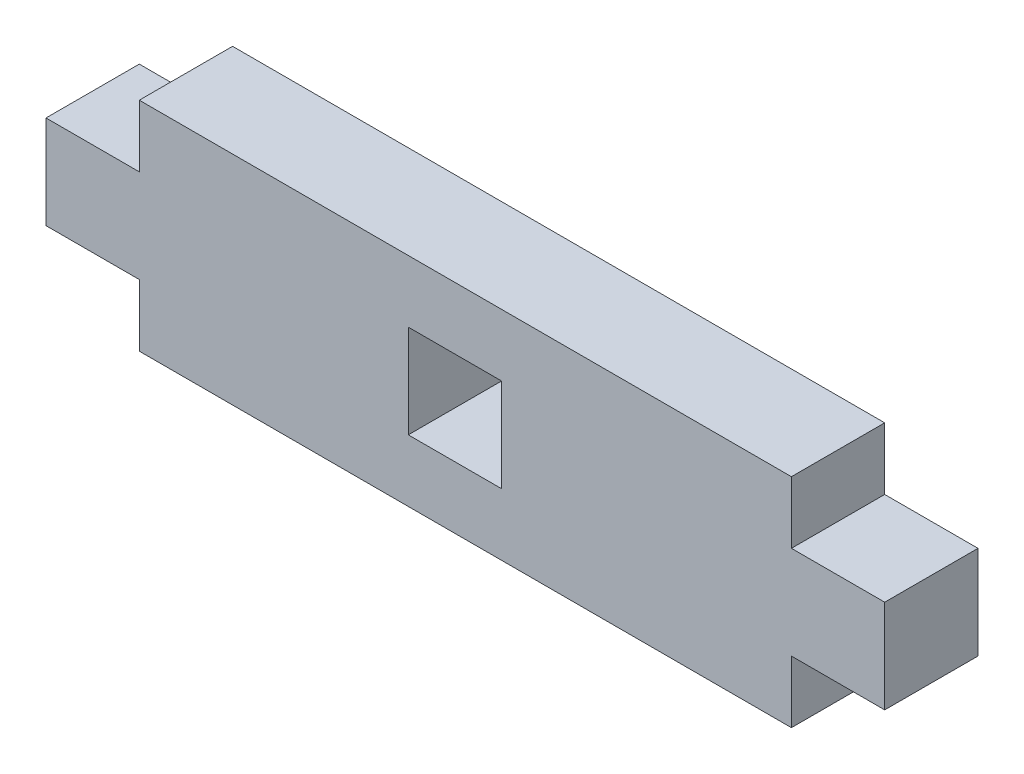
ISO-10303-21;
HEADER;
FILE_DESCRIPTION(('STEP AP214'),'2;1');
FILE_NAME('part.step','',(''),(''),'','','');
FILE_SCHEMA(('AUTOMOTIVE_DESIGN { 1 0 10303 214 1 1 1 1 }'));
ENDSEC;
DATA;
#1=APPLICATION_CONTEXT('core data for automotive mechanical design processes');
#2=APPLICATION_PROTOCOL_DEFINITION('international standard','automotive_design',2000,#1);
#3=PRODUCT_CONTEXT('',#1,'mechanical');
#4=PRODUCT('Part','Part','',(#3));
#5=PRODUCT_RELATED_PRODUCT_CATEGORY('part','',(#4));
#6=PRODUCT_DEFINITION_FORMATION('','',#4);
#7=PRODUCT_DEFINITION_CONTEXT('part definition',#1,'design');
#8=PRODUCT_DEFINITION('design','',#6,#7);
#9=PRODUCT_DEFINITION_SHAPE('','',#8);
#10=(LENGTH_UNIT() NAMED_UNIT(*) SI_UNIT(.MILLI.,.METRE.));
#11=(NAMED_UNIT(*) PLANE_ANGLE_UNIT() SI_UNIT($,.RADIAN.));
#12=(NAMED_UNIT(*) SI_UNIT($,.STERADIAN.) SOLID_ANGLE_UNIT());
#13=UNCERTAINTY_MEASURE_WITH_UNIT(LENGTH_MEASURE(1.E-05),#10,'distance_accuracy_value','');
#14=(GEOMETRIC_REPRESENTATION_CONTEXT(3) GLOBAL_UNCERTAINTY_ASSIGNED_CONTEXT((#13)) GLOBAL_UNIT_ASSIGNED_CONTEXT((#10,
#11,#12)) REPRESENTATION_CONTEXT('',''));
#15=CARTESIAN_POINT('',(0.,0.,0.));
#16=DIRECTION('',(0.,0.,1.));
#17=DIRECTION('',(1.,0.,0.));
#18=AXIS2_PLACEMENT_3D('',#15,#16,#17);
#19=CARTESIAN_POINT('',(5.15,3.425,5.15));
#20=DIRECTION('',(0.,1.,0.));
#21=DIRECTION('',(-1.,0.,0.));
#22=AXIS2_PLACEMENT_3D('',#19,#20,#21);
#23=PLANE('',#22);
#24=DIRECTION('',(1.,0.,0.));
#25=VECTOR('',#24,1.);
#26=CARTESIAN_POINT('',(5.15,3.425,0.));
#27=LINE('',#26,#25);
#28=CARTESIAN_POINT('',(0.,3.425,0.));
#29=VERTEX_POINT('',#28);
#30=CARTESIAN_POINT('',(5.15,3.425,0.));
#31=VERTEX_POINT('',#30);
#32=EDGE_CURVE('E178',#29,#31,#27,.T.);
#33=ORIENTED_EDGE('',*,*,#32,.T.);
#34=DIRECTION('',(0.,0.,-1.));
#35=VECTOR('',#34,1.);
#36=CARTESIAN_POINT('',(5.15,3.425,5.15));
#37=LINE('',#36,#35);
#38=CARTESIAN_POINT('',(5.15,3.425,5.15));
#39=VERTEX_POINT('',#38);
#40=EDGE_CURVE('E11',#39,#31,#37,.T.);
#41=ORIENTED_EDGE('',*,*,#40,.F.);
#42=DIRECTION('',(1.,0.,0.));
#43=VECTOR('',#42,1.);
#44=CARTESIAN_POINT('',(5.15,3.425,5.15));
#45=LINE('',#44,#43);
#46=CARTESIAN_POINT('',(0.,3.425,5.15));
#47=VERTEX_POINT('',#46);
#48=EDGE_CURVE('E182',#47,#39,#45,.T.);
#49=ORIENTED_EDGE('',*,*,#48,.F.);
#50=DIRECTION('',(0.,0.,-1.));
#51=VECTOR('',#50,1.);
#52=CARTESIAN_POINT('',(0.,3.425,5.15));
#53=LINE('',#52,#51);
#54=EDGE_CURVE('E208',#47,#29,#53,.T.);
#55=ORIENTED_EDGE('',*,*,#54,.T.);
#56=EDGE_LOOP('',(#33,#41,#49,#55));
#57=FACE_BOUND('',#56,.T.);
#58=ADVANCED_FACE('F33',(#57),#23,.F.);
#59=CARTESIAN_POINT('',(5.15,0.,5.15));
#60=DIRECTION('',(1.,0.,0.));
#61=DIRECTION('',(0.,1.,0.));
#62=AXIS2_PLACEMENT_3D('',#59,#60,#61);
#63=PLANE('',#62);
#64=DIRECTION('',(0.,-1.,0.));
#65=VECTOR('',#64,1.);
#66=CARTESIAN_POINT('',(5.15,0.,0.));
#67=LINE('',#66,#65);
#68=CARTESIAN_POINT('',(5.15,0.,0.));
#69=VERTEX_POINT('',#68);
#70=EDGE_CURVE('E211',#31,#69,#67,.T.);
#71=ORIENTED_EDGE('',*,*,#70,.T.);
#72=DIRECTION('',(0.,0.,-1.));
#73=VECTOR('',#72,1.);
#74=CARTESIAN_POINT('',(5.15,0.,5.15));
#75=LINE('',#74,#73);
#76=CARTESIAN_POINT('',(5.15,0.,5.15));
#77=VERTEX_POINT('',#76);
#78=EDGE_CURVE('E40',#77,#69,#75,.T.);
#79=ORIENTED_EDGE('',*,*,#78,.F.);
#80=DIRECTION('',(0.,-1.,0.));
#81=VECTOR('',#80,1.);
#82=CARTESIAN_POINT('',(5.15,0.,5.15));
#83=LINE('',#82,#81);
#84=EDGE_CURVE('E185',#39,#77,#83,.T.);
#85=ORIENTED_EDGE('',*,*,#84,.F.);
#86=ORIENTED_EDGE('',*,*,#40,.T.);
#87=EDGE_LOOP('',(#71,#79,#85,#86));
#88=FACE_BOUND('',#87,.T.);
#89=ADVANCED_FACE('F286',(#88),#63,.F.);
#90=CARTESIAN_POINT('',(5.15,0.,5.15));
#91=DIRECTION('',(0.,1.,0.));
#92=DIRECTION('',(0.,0.,1.));
#93=AXIS2_PLACEMENT_3D('',#90,#91,#92);
#94=PLANE('',#93);
#95=DIRECTION('',(1.,0.,0.));
#96=VECTOR('',#95,1.);
#97=CARTESIAN_POINT('',(5.15,0.,0.));
#98=LINE('',#97,#96);
#99=CARTESIAN_POINT('',(41.15,0.,0.));
#100=VERTEX_POINT('',#99);
#101=EDGE_CURVE('E213',#69,#100,#98,.T.);
#102=ORIENTED_EDGE('',*,*,#101,.T.);
#103=DIRECTION('',(0.,0.,-1.));
#104=VECTOR('',#103,1.);
#105=CARTESIAN_POINT('',(41.15,0.,5.15));
#106=LINE('',#105,#104);
#107=CARTESIAN_POINT('',(41.15,0.,5.15));
#108=VERTEX_POINT('',#107);
#109=EDGE_CURVE('E258',#108,#100,#106,.T.);
#110=ORIENTED_EDGE('',*,*,#109,.F.);
#111=DIRECTION('',(1.,0.,0.));
#112=VECTOR('',#111,1.);
#113=CARTESIAN_POINT('',(5.15,0.,5.15));
#114=LINE('',#113,#112);
#115=EDGE_CURVE('E188',#77,#108,#114,.T.);
#116=ORIENTED_EDGE('',*,*,#115,.F.);
#117=ORIENTED_EDGE('',*,*,#78,.T.);
#118=EDGE_LOOP('',(#102,#110,#116,#117));
#119=FACE_BOUND('',#118,.T.);
#120=ADVANCED_FACE('F265',(#119),#94,.F.);
#121=CARTESIAN_POINT('',(41.15,0.,5.15));
#122=DIRECTION('',(-1.,0.,0.));
#123=DIRECTION('',(0.,0.,1.));
#124=AXIS2_PLACEMENT_3D('',#121,#122,#123);
#125=PLANE('',#124);
#126=DIRECTION('',(0.,1.,0.));
#127=VECTOR('',#126,1.);
#128=CARTESIAN_POINT('',(41.15,0.,0.));
#129=LINE('',#128,#127);
#130=CARTESIAN_POINT('',(41.15,3.425,0.));
#131=VERTEX_POINT('',#130);
#132=EDGE_CURVE('E215',#100,#131,#129,.T.);
#133=ORIENTED_EDGE('',*,*,#132,.T.);
#134=DIRECTION('',(0.,0.,-1.));
#135=VECTOR('',#134,1.);
#136=CARTESIAN_POINT('',(41.15,3.425,5.15));
#137=LINE('',#136,#135);
#138=CARTESIAN_POINT('',(41.15,3.425,5.15));
#139=VERTEX_POINT('',#138);
#140=EDGE_CURVE('E255',#139,#131,#137,.T.);
#141=ORIENTED_EDGE('',*,*,#140,.F.);
#142=DIRECTION('',(0.,1.,0.));
#143=VECTOR('',#142,1.);
#144=CARTESIAN_POINT('',(41.15,0.,5.15));
#145=LINE('',#144,#143);
#146=EDGE_CURVE('E190',#108,#139,#145,.T.);
#147=ORIENTED_EDGE('',*,*,#146,.F.);
#148=ORIENTED_EDGE('',*,*,#109,.T.);
#149=EDGE_LOOP('',(#133,#141,#147,#148));
#150=FACE_BOUND('',#149,.T.);
#151=ADVANCED_FACE('F274',(#150),#125,.F.);
#152=CARTESIAN_POINT('',(46.3,3.425,5.15));
#153=DIRECTION('',(0.,1.,0.));
#154=DIRECTION('',(0.,0.,1.));
#155=AXIS2_PLACEMENT_3D('',#152,#153,#154);
#156=PLANE('',#155);
#157=DIRECTION('',(1.,0.,0.));
#158=VECTOR('',#157,1.);
#159=CARTESIAN_POINT('',(46.3,3.425,0.));
#160=LINE('',#159,#158);
#161=CARTESIAN_POINT('',(46.3,3.425,0.));
#162=VERTEX_POINT('',#161);
#163=EDGE_CURVE('E217',#131,#162,#160,.T.);
#164=ORIENTED_EDGE('',*,*,#163,.T.);
#165=DIRECTION('',(0.,0.,-1.));
#166=VECTOR('',#165,1.);
#167=CARTESIAN_POINT('',(46.3,3.425,5.15));
#168=LINE('',#167,#166);
#169=CARTESIAN_POINT('',(46.3,3.425,5.15));
#170=VERTEX_POINT('',#169);
#171=EDGE_CURVE('E252',#170,#162,#168,.T.);
#172=ORIENTED_EDGE('',*,*,#171,.F.);
#173=DIRECTION('',(1.,0.,0.));
#174=VECTOR('',#173,1.);
#175=CARTESIAN_POINT('',(46.3,3.425,5.15));
#176=LINE('',#175,#174);
#177=EDGE_CURVE('E192',#139,#170,#176,.T.);
#178=ORIENTED_EDGE('',*,*,#177,.F.);
#179=ORIENTED_EDGE('',*,*,#140,.T.);
#180=EDGE_LOOP('',(#164,#172,#178,#179));
#181=FACE_BOUND('',#180,.T.);
#182=ADVANCED_FACE('F278',(#181),#156,.F.);
#183=CARTESIAN_POINT('',(46.3,8.575,5.15));
#184=DIRECTION('',(-1.,0.,0.));
#185=DIRECTION('',(0.,-1.,0.));
#186=AXIS2_PLACEMENT_3D('',#183,#184,#185);
#187=PLANE('',#186);
#188=DIRECTION('',(0.,1.,0.));
#189=VECTOR('',#188,1.);
#190=CARTESIAN_POINT('',(46.3,8.575,0.));
#191=LINE('',#190,#189);
#192=CARTESIAN_POINT('',(46.3,8.575,0.));
#193=VERTEX_POINT('',#192);
#194=EDGE_CURVE('E219',#162,#193,#191,.T.);
#195=ORIENTED_EDGE('',*,*,#194,.T.);
#196=DIRECTION('',(0.,0.,-1.));
#197=VECTOR('',#196,1.);
#198=CARTESIAN_POINT('',(46.3,8.575,5.15));
#199=LINE('',#198,#197);
#200=CARTESIAN_POINT('',(46.3,8.575,5.15));
#201=VERTEX_POINT('',#200);
#202=EDGE_CURVE('E249',#201,#193,#199,.T.);
#203=ORIENTED_EDGE('',*,*,#202,.F.);
#204=DIRECTION('',(0.,1.,0.));
#205=VECTOR('',#204,1.);
#206=CARTESIAN_POINT('',(46.3,8.575,5.15));
#207=LINE('',#206,#205);
#208=EDGE_CURVE('E194',#170,#201,#207,.T.);
#209=ORIENTED_EDGE('',*,*,#208,.F.);
#210=ORIENTED_EDGE('',*,*,#171,.T.);
#211=EDGE_LOOP('',(#195,#203,#209,#210));
#212=FACE_BOUND('',#211,.T.);
#213=ADVANCED_FACE('F319',(#212),#187,.F.);
#214=CARTESIAN_POINT('',(41.15,8.575,5.15));
#215=DIRECTION('',(0.,-1.,0.));
#216=DIRECTION('',(0.,0.,-1.));
#217=AXIS2_PLACEMENT_3D('',#214,#215,#216);
#218=PLANE('',#217);
#219=DIRECTION('',(-1.,0.,0.));
#220=VECTOR('',#219,1.);
#221=CARTESIAN_POINT('',(41.15,8.575,0.));
#222=LINE('',#221,#220);
#223=CARTESIAN_POINT('',(41.15,8.575,0.));
#224=VERTEX_POINT('',#223);
#225=EDGE_CURVE('E221',#193,#224,#222,.T.);
#226=ORIENTED_EDGE('',*,*,#225,.T.);
#227=DIRECTION('',(0.,0.,-1.));
#228=VECTOR('',#227,1.);
#229=CARTESIAN_POINT('',(41.15,8.575,5.15));
#230=LINE('',#229,#228);
#231=CARTESIAN_POINT('',(41.15,8.575,5.15));
#232=VERTEX_POINT('',#231);
#233=EDGE_CURVE('E246',#232,#224,#230,.T.);
#234=ORIENTED_EDGE('',*,*,#233,.F.);
#235=DIRECTION('',(-1.,0.,0.));
#236=VECTOR('',#235,1.);
#237=CARTESIAN_POINT('',(41.15,8.575,5.15));
#238=LINE('',#237,#236);
#239=EDGE_CURVE('E196',#201,#232,#238,.T.);
#240=ORIENTED_EDGE('',*,*,#239,.F.);
#241=ORIENTED_EDGE('',*,*,#202,.T.);
#242=EDGE_LOOP('',(#226,#234,#240,#241));
#243=FACE_BOUND('',#242,.T.);
#244=ADVANCED_FACE('F317',(#243),#218,.F.);
#245=CARTESIAN_POINT('',(41.15,8.575,5.15));
#246=DIRECTION('',(-1.,0.,0.));
#247=DIRECTION('',(0.,0.,1.));
#248=AXIS2_PLACEMENT_3D('',#245,#246,#247);
#249=PLANE('',#248);
#250=DIRECTION('',(0.,1.,0.));
#251=VECTOR('',#250,1.);
#252=CARTESIAN_POINT('',(41.15,8.575,0.));
#253=LINE('',#252,#251);
#254=CARTESIAN_POINT('',(41.15,12.,0.));
#255=VERTEX_POINT('',#254);
#256=EDGE_CURVE('E223',#224,#255,#253,.T.);
#257=ORIENTED_EDGE('',*,*,#256,.T.);
#258=DIRECTION('',(0.,0.,-1.));
#259=VECTOR('',#258,1.);
#260=CARTESIAN_POINT('',(41.15,12.,5.15));
#261=LINE('',#260,#259);
#262=CARTESIAN_POINT('',(41.15,12.,5.15));
#263=VERTEX_POINT('',#262);
#264=EDGE_CURVE('E243',#263,#255,#261,.T.);
#265=ORIENTED_EDGE('',*,*,#264,.F.);
#266=DIRECTION('',(0.,1.,0.));
#267=VECTOR('',#266,1.);
#268=CARTESIAN_POINT('',(41.15,8.575,5.15));
#269=LINE('',#268,#267);
#270=EDGE_CURVE('E198',#232,#263,#269,.T.);
#271=ORIENTED_EDGE('',*,*,#270,.F.);
#272=ORIENTED_EDGE('',*,*,#233,.T.);
#273=EDGE_LOOP('',(#257,#265,#271,#272));
#274=FACE_BOUND('',#273,.T.);
#275=ADVANCED_FACE('F313',(#274),#249,.F.);
#276=CARTESIAN_POINT('',(41.15,12.,5.15));
#277=DIRECTION('',(0.,-1.,0.));
#278=DIRECTION('',(1.,0.,0.));
#279=AXIS2_PLACEMENT_3D('',#276,#277,#278);
#280=PLANE('',#279);
#281=DIRECTION('',(-1.,0.,0.));
#282=VECTOR('',#281,1.);
#283=CARTESIAN_POINT('',(41.15,12.,0.));
#284=LINE('',#283,#282);
#285=CARTESIAN_POINT('',(5.15000000000002,12.,0.));
#286=VERTEX_POINT('',#285);
#287=EDGE_CURVE('E225',#255,#286,#284,.T.);
#288=ORIENTED_EDGE('',*,*,#287,.T.);
#289=DIRECTION('',(0.,0.,-1.));
#290=VECTOR('',#289,1.);
#291=CARTESIAN_POINT('',(5.15000000000002,12.,5.15));
#292=LINE('',#291,#290);
#293=CARTESIAN_POINT('',(5.15000000000002,12.,5.15));
#294=VERTEX_POINT('',#293);
#295=EDGE_CURVE('E240',#294,#286,#292,.T.);
#296=ORIENTED_EDGE('',*,*,#295,.F.);
#297=DIRECTION('',(-1.,0.,0.));
#298=VECTOR('',#297,1.);
#299=CARTESIAN_POINT('',(41.15,12.,5.15));
#300=LINE('',#299,#298);
#301=EDGE_CURVE('E200',#263,#294,#300,.T.);
#302=ORIENTED_EDGE('',*,*,#301,.F.);
#303=ORIENTED_EDGE('',*,*,#264,.T.);
#304=EDGE_LOOP('',(#288,#296,#302,#303));
#305=FACE_BOUND('',#304,.T.);
#306=ADVANCED_FACE('F308',(#305),#280,.F.);
#307=CARTESIAN_POINT('',(5.15,8.575,5.15));
#308=DIRECTION('',(1.,0.,0.));
#309=DIRECTION('',(0.,1.,0.));
#310=AXIS2_PLACEMENT_3D('',#307,#308,#309);
#311=PLANE('',#310);
#312=DIRECTION('',(0.,-1.,0.));
#313=VECTOR('',#312,1.);
#314=CARTESIAN_POINT('',(5.15,8.575,0.));
#315=LINE('',#314,#313);
#316=CARTESIAN_POINT('',(5.15,8.575,0.));
#317=VERTEX_POINT('',#316);
#318=EDGE_CURVE('E227',#286,#317,#315,.T.);
#319=ORIENTED_EDGE('',*,*,#318,.T.);
#320=DIRECTION('',(0.,0.,-1.));
#321=VECTOR('',#320,1.);
#322=CARTESIAN_POINT('',(5.15,8.575,5.15));
#323=LINE('',#322,#321);
#324=CARTESIAN_POINT('',(5.15,8.575,5.15));
#325=VERTEX_POINT('',#324);
#326=EDGE_CURVE('E237',#325,#317,#323,.T.);
#327=ORIENTED_EDGE('',*,*,#326,.F.);
#328=DIRECTION('',(0.,-1.,0.));
#329=VECTOR('',#328,1.);
#330=CARTESIAN_POINT('',(5.15,8.575,5.15));
#331=LINE('',#330,#329);
#332=EDGE_CURVE('E202',#294,#325,#331,.T.);
#333=ORIENTED_EDGE('',*,*,#332,.F.);
#334=ORIENTED_EDGE('',*,*,#295,.T.);
#335=EDGE_LOOP('',(#319,#327,#333,#334));
#336=FACE_BOUND('',#335,.T.);
#337=ADVANCED_FACE('F302',(#336),#311,.F.);
#338=CARTESIAN_POINT('',(0.,8.575,5.15));
#339=DIRECTION('',(0.,-1.,0.));
#340=DIRECTION('',(0.,0.,-1.));
#341=AXIS2_PLACEMENT_3D('',#338,#339,#340);
#342=PLANE('',#341);
#343=DIRECTION('',(-1.,0.,0.));
#344=VECTOR('',#343,1.);
#345=CARTESIAN_POINT('',(0.,8.575,0.));
#346=LINE('',#345,#344);
#347=CARTESIAN_POINT('',(0.,8.575,0.));
#348=VERTEX_POINT('',#347);
#349=EDGE_CURVE('E229',#317,#348,#346,.T.);
#350=ORIENTED_EDGE('',*,*,#349,.T.);
#351=DIRECTION('',(0.,0.,-1.));
#352=VECTOR('',#351,1.);
#353=CARTESIAN_POINT('',(0.,8.575,5.15));
#354=LINE('',#353,#352);
#355=CARTESIAN_POINT('',(0.,8.575,5.15));
#356=VERTEX_POINT('',#355);
#357=EDGE_CURVE('E234',#356,#348,#354,.T.);
#358=ORIENTED_EDGE('',*,*,#357,.F.);
#359=DIRECTION('',(-1.,0.,0.));
#360=VECTOR('',#359,1.);
#361=CARTESIAN_POINT('',(0.,8.575,5.15));
#362=LINE('',#361,#360);
#363=EDGE_CURVE('E204',#325,#356,#362,.T.);
#364=ORIENTED_EDGE('',*,*,#363,.F.);
#365=ORIENTED_EDGE('',*,*,#326,.T.);
#366=EDGE_LOOP('',(#350,#358,#364,#365));
#367=FACE_BOUND('',#366,.T.);
#368=ADVANCED_FACE('F298',(#367),#342,.F.);
#369=CARTESIAN_POINT('',(0.,3.425,5.15));
#370=DIRECTION('',(1.,0.,0.));
#371=DIRECTION('',(0.,1.,0.));
#372=AXIS2_PLACEMENT_3D('',#369,#370,#371);
#373=PLANE('',#372);
#374=DIRECTION('',(0.,-1.,0.));
#375=VECTOR('',#374,1.);
#376=CARTESIAN_POINT('',(0.,3.425,0.));
#377=LINE('',#376,#375);
#378=EDGE_CURVE('E186',#348,#29,#377,.T.);
#379=ORIENTED_EDGE('',*,*,#378,.T.);
#380=ORIENTED_EDGE('',*,*,#54,.F.);
#381=DIRECTION('',(0.,-1.,0.));
#382=VECTOR('',#381,1.);
#383=CARTESIAN_POINT('',(0.,3.425,5.15));
#384=LINE('',#383,#382);
#385=EDGE_CURVE('E206',#356,#47,#384,.T.);
#386=ORIENTED_EDGE('',*,*,#385,.F.);
#387=ORIENTED_EDGE('',*,*,#357,.T.);
#388=EDGE_LOOP('',(#379,#380,#386,#387));
#389=FACE_BOUND('',#388,.T.);
#390=ADVANCED_FACE('F293',(#389),#373,.F.);
#391=CARTESIAN_POINT('',(0.,0.,5.15));
#392=DIRECTION('',(0.,0.,-1.));
#393=DIRECTION('',(-1.,0.,0.));
#394=AXIS2_PLACEMENT_3D('',#391,#392,#393);
#395=PLANE('',#394);
#396=DIRECTION('',(0.,-1.,0.));
#397=VECTOR('',#396,1.);
#398=CARTESIAN_POINT('',(20.,8.575,5.15));
#399=LINE('',#398,#397);
#400=CARTESIAN_POINT('',(20.,8.575,5.15));
#401=VERTEX_POINT('',#400);
#402=CARTESIAN_POINT('',(20.,3.425,5.15));
#403=VERTEX_POINT('',#402);
#404=EDGE_CURVE('E172',#401,#403,#399,.T.);
#405=ORIENTED_EDGE('',*,*,#404,.F.);
#406=DIRECTION('',(-1.,0.,0.));
#407=VECTOR('',#406,1.);
#408=CARTESIAN_POINT('',(25.15,8.575,5.15));
#409=LINE('',#408,#407);
#410=CARTESIAN_POINT('',(25.15,8.575,5.15));
#411=VERTEX_POINT('',#410);
#412=EDGE_CURVE('E47',#411,#401,#409,.T.);
#413=ORIENTED_EDGE('',*,*,#412,.F.);
#414=DIRECTION('',(0.,1.,0.));
#415=VECTOR('',#414,1.);
#416=CARTESIAN_POINT('',(25.15,8.575,5.15));
#417=LINE('',#416,#415);
#418=CARTESIAN_POINT('',(25.15,3.425,5.15));
#419=VERTEX_POINT('',#418);
#420=EDGE_CURVE('E163',#419,#411,#417,.T.);
#421=ORIENTED_EDGE('',*,*,#420,.F.);
#422=DIRECTION('',(1.,0.,0.));
#423=VECTOR('',#422,1.);
#424=CARTESIAN_POINT('',(25.15,3.425,5.15));
#425=LINE('',#424,#423);
#426=EDGE_CURVE('E166',#403,#419,#425,.T.);
#427=ORIENTED_EDGE('',*,*,#426,.F.);
#428=EDGE_LOOP('',(#405,#413,#421,#427));
#429=FACE_BOUND('',#428,.T.);
#430=ORIENTED_EDGE('',*,*,#48,.T.);
#431=ORIENTED_EDGE('',*,*,#84,.T.);
#432=ORIENTED_EDGE('',*,*,#115,.T.);
#433=ORIENTED_EDGE('',*,*,#146,.T.);
#434=ORIENTED_EDGE('',*,*,#177,.T.);
#435=ORIENTED_EDGE('',*,*,#208,.T.);
#436=ORIENTED_EDGE('',*,*,#239,.T.);
#437=ORIENTED_EDGE('',*,*,#270,.T.);
#438=ORIENTED_EDGE('',*,*,#301,.T.);
#439=ORIENTED_EDGE('',*,*,#332,.T.);
#440=ORIENTED_EDGE('',*,*,#363,.T.);
#441=ORIENTED_EDGE('',*,*,#385,.T.);
#442=EDGE_LOOP('',(#430,#431,#432,#433,#434,#435,#436,#437,#438,#439,#440,#441));
#443=FACE_BOUND('',#442,.T.);
#444=ADVANCED_FACE('F282',(#429,#443),#395,.F.);
#445=CARTESIAN_POINT('',(0.,0.,0.));
#446=DIRECTION('',(0.,0.,-1.));
#447=DIRECTION('',(-1.,0.,0.));
#448=AXIS2_PLACEMENT_3D('',#445,#446,#447);
#449=PLANE('',#448);
#450=DIRECTION('',(-1.,0.,0.));
#451=VECTOR('',#450,1.);
#452=CARTESIAN_POINT('',(25.15,8.575,0.));
#453=LINE('',#452,#451);
#454=CARTESIAN_POINT('',(25.15,8.575,0.));
#455=VERTEX_POINT('',#454);
#456=CARTESIAN_POINT('',(20.,8.575,0.));
#457=VERTEX_POINT('',#456);
#458=EDGE_CURVE('E147',#455,#457,#453,.T.);
#459=ORIENTED_EDGE('',*,*,#458,.T.);
#460=DIRECTION('',(0.,-1.,0.));
#461=VECTOR('',#460,1.);
#462=CARTESIAN_POINT('',(20.,8.575,0.));
#463=LINE('',#462,#461);
#464=CARTESIAN_POINT('',(20.,3.425,0.));
#465=VERTEX_POINT('',#464);
#466=EDGE_CURVE('E156',#457,#465,#463,.T.);
#467=ORIENTED_EDGE('',*,*,#466,.T.);
#468=DIRECTION('',(1.,0.,0.));
#469=VECTOR('',#468,1.);
#470=CARTESIAN_POINT('',(25.15,3.425,0.));
#471=LINE('',#470,#469);
#472=CARTESIAN_POINT('',(25.15,3.425,0.));
#473=VERTEX_POINT('',#472);
#474=EDGE_CURVE('E55',#465,#473,#471,.T.);
#475=ORIENTED_EDGE('',*,*,#474,.T.);
#476=DIRECTION('',(0.,1.,0.));
#477=VECTOR('',#476,1.);
#478=CARTESIAN_POINT('',(25.15,8.575,0.));
#479=LINE('',#478,#477);
#480=EDGE_CURVE('E153',#473,#455,#479,.T.);
#481=ORIENTED_EDGE('',*,*,#480,.T.);
#482=EDGE_LOOP('',(#459,#467,#475,#481));
#483=FACE_BOUND('',#482,.T.);
#484=ORIENTED_EDGE('',*,*,#32,.F.);
#485=ORIENTED_EDGE('',*,*,#378,.F.);
#486=ORIENTED_EDGE('',*,*,#349,.F.);
#487=ORIENTED_EDGE('',*,*,#318,.F.);
#488=ORIENTED_EDGE('',*,*,#287,.F.);
#489=ORIENTED_EDGE('',*,*,#256,.F.);
#490=ORIENTED_EDGE('',*,*,#225,.F.);
#491=ORIENTED_EDGE('',*,*,#194,.F.);
#492=ORIENTED_EDGE('',*,*,#163,.F.);
#493=ORIENTED_EDGE('',*,*,#132,.F.);
#494=ORIENTED_EDGE('',*,*,#101,.F.);
#495=ORIENTED_EDGE('',*,*,#70,.F.);
#496=EDGE_LOOP('',(#484,#485,#486,#487,#488,#489,#490,#491,#492,#493,#494,#495));
#497=FACE_BOUND('',#496,.T.);
#498=ADVANCED_FACE('F160',(#483,#497),#449,.T.);
#499=CARTESIAN_POINT('',(25.15,8.575,0.));
#500=DIRECTION('',(0.,1.,0.));
#501=DIRECTION('',(0.,0.,1.));
#502=AXIS2_PLACEMENT_3D('',#499,#500,#501);
#503=PLANE('',#502);
#504=ORIENTED_EDGE('',*,*,#412,.T.);
#505=DIRECTION('',(0.,0.,1.));
#506=VECTOR('',#505,1.);
#507=CARTESIAN_POINT('',(20.,8.575,0.));
#508=LINE('',#507,#506);
#509=EDGE_CURVE('E143',#457,#401,#508,.T.);
#510=ORIENTED_EDGE('',*,*,#509,.F.);
#511=ORIENTED_EDGE('',*,*,#458,.F.);
#512=DIRECTION('',(0.,0.,1.));
#513=VECTOR('',#512,1.);
#514=CARTESIAN_POINT('',(25.15,8.575,0.));
#515=LINE('',#514,#513);
#516=EDGE_CURVE('E176',#455,#411,#515,.T.);
#517=ORIENTED_EDGE('',*,*,#516,.T.);
#518=EDGE_LOOP('',(#504,#510,#511,#517));
#519=FACE_BOUND('',#518,.T.);
#520=ADVANCED_FACE('F145',(#519),#503,.F.);
#521=CARTESIAN_POINT('',(25.15,8.575,0.));
#522=DIRECTION('',(1.,0.,0.));
#523=DIRECTION('',(0.,0.,-1.));
#524=AXIS2_PLACEMENT_3D('',#521,#522,#523);
#525=PLANE('',#524);
#526=ORIENTED_EDGE('',*,*,#420,.T.);
#527=ORIENTED_EDGE('',*,*,#516,.F.);
#528=ORIENTED_EDGE('',*,*,#480,.F.);
#529=DIRECTION('',(0.,0.,1.));
#530=VECTOR('',#529,1.);
#531=CARTESIAN_POINT('',(25.15,3.425,0.));
#532=LINE('',#531,#530);
#533=EDGE_CURVE('E179',#473,#419,#532,.T.);
#534=ORIENTED_EDGE('',*,*,#533,.T.);
#535=EDGE_LOOP('',(#526,#527,#528,#534));
#536=FACE_BOUND('',#535,.T.);
#537=ADVANCED_FACE('F422',(#536),#525,.F.);
#538=CARTESIAN_POINT('',(25.15,3.425,0.));
#539=DIRECTION('',(0.,-1.,0.));
#540=DIRECTION('',(1.,0.,0.));
#541=AXIS2_PLACEMENT_3D('',#538,#539,#540);
#542=PLANE('',#541);
#543=ORIENTED_EDGE('',*,*,#426,.T.);
#544=ORIENTED_EDGE('',*,*,#533,.F.);
#545=ORIENTED_EDGE('',*,*,#474,.F.);
#546=DIRECTION('',(0.,0.,1.));
#547=VECTOR('',#546,1.);
#548=CARTESIAN_POINT('',(20.,3.425,0.));
#549=LINE('',#548,#547);
#550=EDGE_CURVE('E152',#465,#403,#549,.T.);
#551=ORIENTED_EDGE('',*,*,#550,.T.);
#552=EDGE_LOOP('',(#543,#544,#545,#551));
#553=FACE_BOUND('',#552,.T.);
#554=ADVANCED_FACE('F431',(#553),#542,.F.);
#555=CARTESIAN_POINT('',(20.,8.575,0.));
#556=DIRECTION('',(-1.,0.,0.));
#557=DIRECTION('',(0.,0.,1.));
#558=AXIS2_PLACEMENT_3D('',#555,#556,#557);
#559=PLANE('',#558);
#560=ORIENTED_EDGE('',*,*,#404,.T.);
#561=ORIENTED_EDGE('',*,*,#550,.F.);
#562=ORIENTED_EDGE('',*,*,#466,.F.);
#563=ORIENTED_EDGE('',*,*,#509,.T.);
#564=EDGE_LOOP('',(#560,#561,#562,#563));
#565=FACE_BOUND('',#564,.T.);
#566=ADVANCED_FACE('F157',(#565),#559,.F.);
#567=CLOSED_SHELL('',(#58,#89,#120,#151,#182,#213,#244,#275,#306,#337,#368,#390,#444,#498,#520,
#537,#554,#566));
#568=MANIFOLD_SOLID_BREP('B2',#567);
#569=ADVANCED_BREP_SHAPE_REPRESENTATION('',(#18,#568),#14);
#570=SHAPE_DEFINITION_REPRESENTATION(#9,#569);
ENDSEC;
END-ISO-10303-21;
